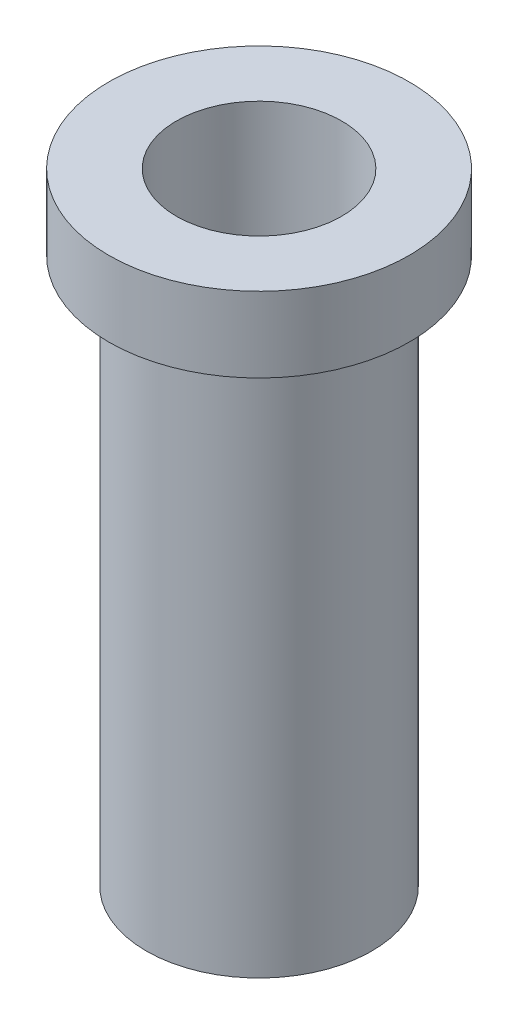
ISO-10303-21;
HEADER;
FILE_DESCRIPTION(('STEP AP214'),'2;1');
FILE_NAME('part.step','',(''),(''),'','','');
FILE_SCHEMA(('AUTOMOTIVE_DESIGN { 1 0 10303 214 1 1 1 1 }'));
ENDSEC;
DATA;
#1=APPLICATION_CONTEXT('core data for automotive mechanical design processes');
#2=APPLICATION_PROTOCOL_DEFINITION('international standard','automotive_design',2000,#1);
#3=PRODUCT_CONTEXT('',#1,'mechanical');
#4=PRODUCT('Part','Part','',(#3));
#5=PRODUCT_RELATED_PRODUCT_CATEGORY('part','',(#4));
#6=PRODUCT_DEFINITION_FORMATION('','',#4);
#7=PRODUCT_DEFINITION_CONTEXT('part definition',#1,'design');
#8=PRODUCT_DEFINITION('design','',#6,#7);
#9=PRODUCT_DEFINITION_SHAPE('','',#8);
#10=(LENGTH_UNIT() NAMED_UNIT(*) SI_UNIT(.MILLI.,.METRE.));
#11=(NAMED_UNIT(*) PLANE_ANGLE_UNIT() SI_UNIT($,.RADIAN.));
#12=(NAMED_UNIT(*) SI_UNIT($,.STERADIAN.) SOLID_ANGLE_UNIT());
#13=UNCERTAINTY_MEASURE_WITH_UNIT(LENGTH_MEASURE(1.E-05),#10,'distance_accuracy_value','');
#14=(GEOMETRIC_REPRESENTATION_CONTEXT(3) GLOBAL_UNCERTAINTY_ASSIGNED_CONTEXT((#13)) GLOBAL_UNIT_ASSIGNED_CONTEXT((#10,
#11,#12)) REPRESENTATION_CONTEXT('',''));
#15=CARTESIAN_POINT('',(0.,0.,0.));
#16=DIRECTION('',(0.,0.,1.));
#17=DIRECTION('',(1.,0.,0.));
#18=AXIS2_PLACEMENT_3D('',#15,#16,#17);
#19=CARTESIAN_POINT('',(0.,0.,0.));
#20=DIRECTION('',(0.,-1.,0.));
#21=DIRECTION('',(0.,0.,-1.));
#22=AXIS2_PLACEMENT_3D('',#19,#20,#21);
#23=PLANE('',#22);
#24=CARTESIAN_POINT('',(7.5,0.,0.));
#25=DIRECTION('',(0.,-1.,0.));
#26=DIRECTION('',(0.,0.,-1.));
#27=AXIS2_PLACEMENT_3D('',#24,#25,#26);
#28=CIRCLE('',#27,5.5);
#29=CARTESIAN_POINT('',(7.5,0.,-5.5));
#30=VERTEX_POINT('',#29);
#31=EDGE_CURVE('E64',#30,#30,#28,.T.);
#32=ORIENTED_EDGE('',*,*,#31,.F.);
#33=EDGE_LOOP('',(#32));
#34=FACE_BOUND('',#33,.T.);
#35=CARTESIAN_POINT('',(7.5,0.,0.));
#36=DIRECTION('',(0.,1.,0.));
#37=DIRECTION('',(0.,0.,1.));
#38=AXIS2_PLACEMENT_3D('',#35,#36,#37);
#39=CIRCLE('',#38,7.5);
#40=CARTESIAN_POINT('',(7.5,0.,7.5));
#41=VERTEX_POINT('',#40);
#42=EDGE_CURVE('E58',#41,#41,#39,.T.);
#43=ORIENTED_EDGE('',*,*,#42,.F.);
#44=EDGE_LOOP('',(#43));
#45=FACE_BOUND('',#44,.T.);
#46=ADVANCED_FACE('F41',(#34,#45),#23,.T.);
#47=CARTESIAN_POINT('',(-2.5,41.3514030581505,0.));
#48=DIRECTION('',(0.,1.,0.));
#49=DIRECTION('',(0.,0.,1.));
#50=AXIS2_PLACEMENT_3D('',#47,#48,#49);
#51=PLANE('',#50);
#52=CARTESIAN_POINT('',(7.5,41.3514030581505,0.));
#53=DIRECTION('',(0.,1.,0.));
#54=DIRECTION('',(0.,0.,1.));
#55=AXIS2_PLACEMENT_3D('',#52,#53,#54);
#56=CIRCLE('',#55,5.5);
#57=CARTESIAN_POINT('',(7.5,41.3514030581505,5.5));
#58=VERTEX_POINT('',#57);
#59=EDGE_CURVE('E68',#58,#58,#56,.T.);
#60=ORIENTED_EDGE('',*,*,#59,.F.);
#61=EDGE_LOOP('',(#60));
#62=FACE_BOUND('',#61,.T.);
#63=CARTESIAN_POINT('',(7.5,41.3514030581505,0.));
#64=DIRECTION('',(0.,1.,0.));
#65=DIRECTION('',(0.,0.,1.));
#66=AXIS2_PLACEMENT_3D('',#63,#64,#65);
#67=CIRCLE('',#66,10.);
#68=CARTESIAN_POINT('',(7.5,41.3514030581505,10.));
#69=VERTEX_POINT('',#68);
#70=EDGE_CURVE('E10',#69,#69,#67,.T.);
#71=ORIENTED_EDGE('',*,*,#70,.T.);
#72=EDGE_LOOP('',(#71));
#73=FACE_BOUND('',#72,.T.);
#74=ADVANCED_FACE('F75',(#62,#73),#51,.T.);
#75=CARTESIAN_POINT('',(7.5,41.3514030581505,0.));
#76=DIRECTION('',(0.,1.,0.));
#77=DIRECTION('',(0.,0.,1.));
#78=AXIS2_PLACEMENT_3D('',#75,#76,#77);
#79=CYLINDRICAL_SURFACE('',#78,10.);
#80=CARTESIAN_POINT('',(7.5,36.3514030581505,0.));
#81=DIRECTION('',(0.,1.,0.));
#82=DIRECTION('',(0.,0.,1.));
#83=AXIS2_PLACEMENT_3D('',#80,#81,#82);
#84=CIRCLE('',#83,10.);
#85=CARTESIAN_POINT('',(7.5,36.3514030581505,10.));
#86=VERTEX_POINT('',#85);
#87=EDGE_CURVE('E48',#86,#86,#84,.T.);
#88=ORIENTED_EDGE('',*,*,#87,.T.);
#89=EDGE_LOOP('',(#88));
#90=FACE_BOUND('',#89,.T.);
#91=ORIENTED_EDGE('',*,*,#70,.F.);
#92=EDGE_LOOP('',(#91));
#93=FACE_BOUND('',#92,.T.);
#94=ADVANCED_FACE('F77',(#90,#93),#79,.T.);
#95=CARTESIAN_POINT('',(0.,36.3514030581505,0.));
#96=DIRECTION('',(0.,-1.,0.));
#97=DIRECTION('',(0.,0.,-1.));
#98=AXIS2_PLACEMENT_3D('',#95,#96,#97);
#99=PLANE('',#98);
#100=CARTESIAN_POINT('',(7.5,36.3514030581505,0.));
#101=DIRECTION('',(0.,1.,0.));
#102=DIRECTION('',(0.,0.,1.));
#103=AXIS2_PLACEMENT_3D('',#100,#101,#102);
#104=CIRCLE('',#103,7.5);
#105=CARTESIAN_POINT('',(7.5,36.3514030581505,7.5));
#106=VERTEX_POINT('',#105);
#107=EDGE_CURVE('E53',#106,#106,#104,.T.);
#108=ORIENTED_EDGE('',*,*,#107,.T.);
#109=EDGE_LOOP('',(#108));
#110=FACE_BOUND('',#109,.T.);
#111=ORIENTED_EDGE('',*,*,#87,.F.);
#112=EDGE_LOOP('',(#111));
#113=FACE_BOUND('',#112,.T.);
#114=ADVANCED_FACE('F82',(#110,#113),#99,.T.);
#115=CARTESIAN_POINT('',(7.5,41.3514030581505,0.));
#116=DIRECTION('',(0.,1.,0.));
#117=DIRECTION('',(0.,0.,1.));
#118=AXIS2_PLACEMENT_3D('',#115,#116,#117);
#119=CYLINDRICAL_SURFACE('',#118,7.5);
#120=ORIENTED_EDGE('',*,*,#42,.T.);
#121=EDGE_LOOP('',(#120));
#122=FACE_BOUND('',#121,.T.);
#123=ORIENTED_EDGE('',*,*,#107,.F.);
#124=EDGE_LOOP('',(#123));
#125=FACE_BOUND('',#124,.T.);
#126=ADVANCED_FACE('F88',(#122,#125),#119,.T.);
#127=CARTESIAN_POINT('',(7.5,-3.64859694184947,0.));
#128=DIRECTION('',(0.,1.,0.));
#129=DIRECTION('',(0.,0.,1.));
#130=AXIS2_PLACEMENT_3D('',#127,#128,#129);
#131=CYLINDRICAL_SURFACE('',#130,5.5);
#132=ORIENTED_EDGE('',*,*,#31,.T.);
#133=EDGE_LOOP('',(#132));
#134=FACE_BOUND('',#133,.T.);
#135=ORIENTED_EDGE('',*,*,#59,.T.);
#136=EDGE_LOOP('',(#135));
#137=FACE_BOUND('',#136,.T.);
#138=ADVANCED_FACE('F73',(#134,#137),#131,.F.);
#139=CLOSED_SHELL('',(#46,#74,#94,#114,#126,#138));
#140=MANIFOLD_SOLID_BREP('B2',#139);
#141=ADVANCED_BREP_SHAPE_REPRESENTATION('',(#18,#140),#14);
#142=SHAPE_DEFINITION_REPRESENTATION(#9,#141);
ENDSEC;
END-ISO-10303-21;
